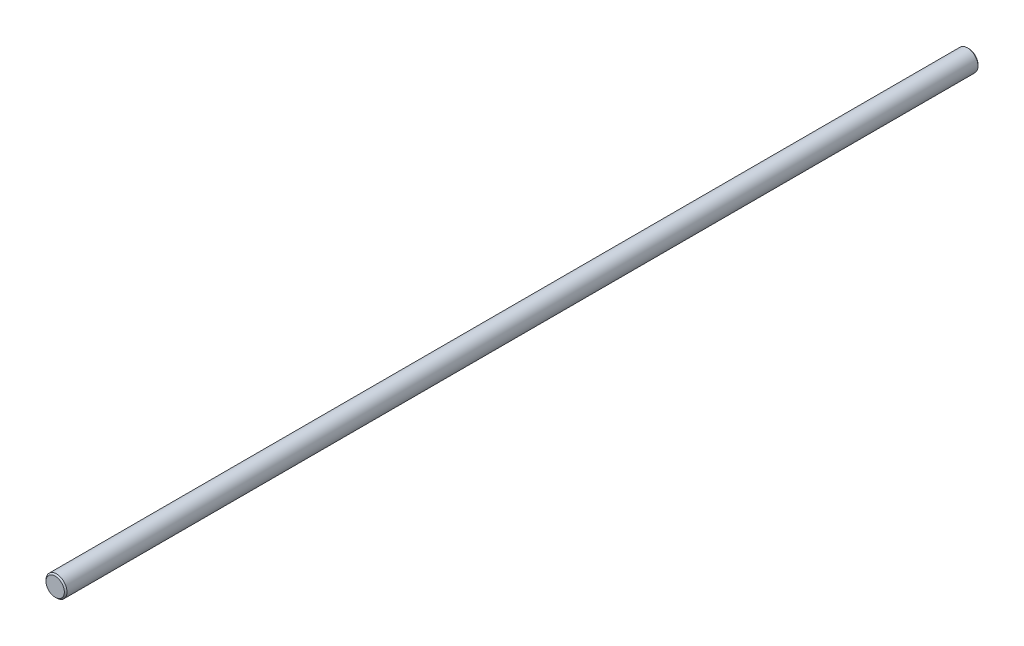
ISO-10303-21;
HEADER;
FILE_DESCRIPTION(('STEP AP214'),'2;1');
FILE_NAME('part.step','',(''),(''),'','','');
FILE_SCHEMA(('AUTOMOTIVE_DESIGN { 1 0 10303 214 1 1 1 1 }'));
ENDSEC;
DATA;
#1=APPLICATION_CONTEXT('core data for automotive mechanical design processes');
#2=APPLICATION_PROTOCOL_DEFINITION('international standard','automotive_design',2000,#1);
#3=PRODUCT_CONTEXT('',#1,'mechanical');
#4=PRODUCT('Part','Part','',(#3));
#5=PRODUCT_RELATED_PRODUCT_CATEGORY('part','',(#4));
#6=PRODUCT_DEFINITION_FORMATION('','',#4);
#7=PRODUCT_DEFINITION_CONTEXT('part definition',#1,'design');
#8=PRODUCT_DEFINITION('design','',#6,#7);
#9=PRODUCT_DEFINITION_SHAPE('','',#8);
#10=(LENGTH_UNIT() NAMED_UNIT(*) SI_UNIT(.MILLI.,.METRE.));
#11=(NAMED_UNIT(*) PLANE_ANGLE_UNIT() SI_UNIT($,.RADIAN.));
#12=(NAMED_UNIT(*) SI_UNIT($,.STERADIAN.) SOLID_ANGLE_UNIT());
#13=UNCERTAINTY_MEASURE_WITH_UNIT(LENGTH_MEASURE(1.E-05),#10,'distance_accuracy_value','');
#14=(GEOMETRIC_REPRESENTATION_CONTEXT(3) GLOBAL_UNCERTAINTY_ASSIGNED_CONTEXT((#13)) GLOBAL_UNIT_ASSIGNED_CONTEXT((#10,
#11,#12)) REPRESENTATION_CONTEXT('',''));
#15=CARTESIAN_POINT('',(0.,0.,0.));
#16=DIRECTION('',(0.,0.,1.));
#17=DIRECTION('',(1.,0.,0.));
#18=AXIS2_PLACEMENT_3D('',#15,#16,#17);
#19=CARTESIAN_POINT('',(0.,0.,-174.));
#20=DIRECTION('',(0.,0.,1.));
#21=DIRECTION('',(1.,0.,0.));
#22=AXIS2_PLACEMENT_3D('',#19,#20,#21);
#23=PLANE('',#22);
#24=CARTESIAN_POINT('',(0.,0.,-173.999999999978));
#25=DIRECTION('',(0.,0.,1.));
#26=DIRECTION('',(1.,0.,0.));
#27=AXIS2_PLACEMENT_3D('',#24,#25,#26);
#28=CIRCLE('',#27,3.50000000003092);
#29=CARTESIAN_POINT('',(3.50000000003092,0.,-173.999999999978));
#30=VERTEX_POINT('',#29);
#31=EDGE_CURVE('E18',#30,#30,#28,.T.);
#32=ORIENTED_EDGE('',*,*,#31,.F.);
#33=EDGE_LOOP('',(#32));
#34=FACE_BOUND('',#33,.T.);
#35=ADVANCED_FACE('F15',(#34),#23,.F.);
#36=CARTESIAN_POINT('',(0.,0.,174.));
#37=DIRECTION('',(0.,0.,1.));
#38=DIRECTION('',(1.,0.,0.));
#39=AXIS2_PLACEMENT_3D('',#36,#37,#38);
#40=PLANE('',#39);
#41=CARTESIAN_POINT('',(0.,0.,173.999999999978));
#42=DIRECTION('',(0.,0.,-1.));
#43=DIRECTION('',(-1.,0.,0.));
#44=AXIS2_PLACEMENT_3D('',#41,#42,#43);
#45=CIRCLE('',#44,3.49999999997408);
#46=CARTESIAN_POINT('',(-3.49999999997408,0.,173.999999999978));
#47=VERTEX_POINT('',#46);
#48=EDGE_CURVE('E27',#47,#47,#45,.T.);
#49=ORIENTED_EDGE('',*,*,#48,.F.);
#50=EDGE_LOOP('',(#49));
#51=FACE_BOUND('',#50,.T.);
#52=ADVANCED_FACE('F42',(#51),#40,.T.);
#53=CARTESIAN_POINT('',(0.,0.,-173.500000000161));
#54=DIRECTION('',(0.,0.,1.));
#55=DIRECTION('',(1.,0.,0.));
#56=AXIS2_PLACEMENT_3D('',#53,#54,#55);
#57=CONICAL_SURFACE('',#56,3.99999999984857,0.785398163397448);
#58=CARTESIAN_POINT('',(0.,0.,-173.5));
#59=DIRECTION('',(0.,0.,1.));
#60=DIRECTION('',(1.,0.,0.));
#61=AXIS2_PLACEMENT_3D('',#58,#59,#60);
#62=CIRCLE('',#61,4.);
#63=CARTESIAN_POINT('',(4.,0.,-173.5));
#64=VERTEX_POINT('',#63);
#65=EDGE_CURVE('E22',#64,#64,#62,.T.);
#66=ORIENTED_EDGE('',*,*,#65,.F.);
#67=EDGE_LOOP('',(#66));
#68=FACE_BOUND('',#67,.T.);
#69=ORIENTED_EDGE('',*,*,#31,.T.);
#70=EDGE_LOOP('',(#69));
#71=FACE_BOUND('',#70,.T.);
#72=ADVANCED_FACE('F39',(#68,#71),#57,.T.);
#73=CARTESIAN_POINT('',(0.,0.,173.500000000047));
#74=DIRECTION('',(0.,0.,-1.));
#75=DIRECTION('',(-1.,0.,0.));
#76=AXIS2_PLACEMENT_3D('',#73,#74,#75);
#77=CONICAL_SURFACE('',#76,3.99999999990541,0.785398163397448);
#78=ORIENTED_EDGE('',*,*,#48,.T.);
#79=EDGE_LOOP('',(#78));
#80=FACE_BOUND('',#79,.T.);
#81=CARTESIAN_POINT('',(0.,0.,173.5));
#82=DIRECTION('',(0.,0.,1.));
#83=DIRECTION('',(1.,0.,0.));
#84=AXIS2_PLACEMENT_3D('',#81,#82,#83);
#85=CIRCLE('',#84,4.);
#86=CARTESIAN_POINT('',(4.,0.,173.5));
#87=VERTEX_POINT('',#86);
#88=EDGE_CURVE('E9',#87,#87,#85,.F.);
#89=ORIENTED_EDGE('',*,*,#88,.F.);
#90=EDGE_LOOP('',(#89));
#91=FACE_BOUND('',#90,.T.);
#92=ADVANCED_FACE('F49',(#80,#91),#77,.T.);
#93=CARTESIAN_POINT('',(0.,0.,-174.));
#94=DIRECTION('',(0.,0.,1.));
#95=DIRECTION('',(1.,0.,0.));
#96=AXIS2_PLACEMENT_3D('',#93,#94,#95);
#97=CYLINDRICAL_SURFACE('',#96,4.);
#98=ORIENTED_EDGE('',*,*,#88,.T.);
#99=EDGE_LOOP('',(#98));
#100=FACE_BOUND('',#99,.T.);
#101=ORIENTED_EDGE('',*,*,#65,.T.);
#102=EDGE_LOOP('',(#101));
#103=FACE_BOUND('',#102,.T.);
#104=ADVANCED_FACE('F47',(#100,#103),#97,.T.);
#105=CLOSED_SHELL('',(#35,#52,#72,#92,#104));
#106=MANIFOLD_SOLID_BREP('B1',#105);
#107=ADVANCED_BREP_SHAPE_REPRESENTATION('',(#18,#106),#14);
#108=SHAPE_DEFINITION_REPRESENTATION(#9,#107);
ENDSEC;
END-ISO-10303-21;
